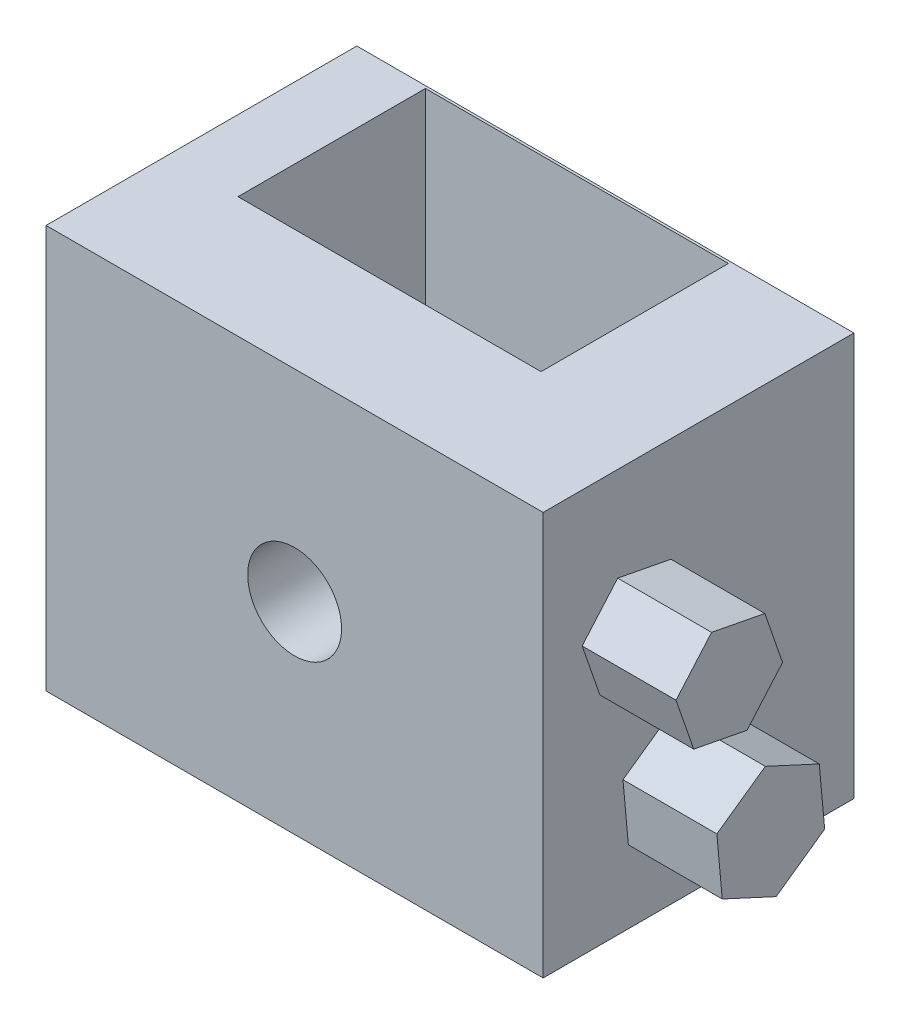
ISO-10303-21;
HEADER;
FILE_DESCRIPTION(('STEP AP214'),'2;1');
FILE_NAME('part.step','',(''),(''),'','','');
FILE_SCHEMA(('AUTOMOTIVE_DESIGN { 1 0 10303 214 1 1 1 1 }'));
ENDSEC;
DATA;
#1=APPLICATION_CONTEXT('core data for automotive mechanical design processes');
#2=APPLICATION_PROTOCOL_DEFINITION('international standard','automotive_design',2000,#1);
#3=PRODUCT_CONTEXT('',#1,'mechanical');
#4=PRODUCT('Part','Part','',(#3));
#5=PRODUCT_RELATED_PRODUCT_CATEGORY('part','',(#4));
#6=PRODUCT_DEFINITION_FORMATION('','',#4);
#7=PRODUCT_DEFINITION_CONTEXT('part definition',#1,'design');
#8=PRODUCT_DEFINITION('design','',#6,#7);
#9=PRODUCT_DEFINITION_SHAPE('','',#8);
#10=(LENGTH_UNIT() NAMED_UNIT(*) SI_UNIT(.MILLI.,.METRE.));
#11=(NAMED_UNIT(*) PLANE_ANGLE_UNIT() SI_UNIT($,.RADIAN.));
#12=(NAMED_UNIT(*) SI_UNIT($,.STERADIAN.) SOLID_ANGLE_UNIT());
#13=UNCERTAINTY_MEASURE_WITH_UNIT(LENGTH_MEASURE(1.E-05),#10,'distance_accuracy_value','');
#14=(GEOMETRIC_REPRESENTATION_CONTEXT(3) GLOBAL_UNCERTAINTY_ASSIGNED_CONTEXT((#13)) GLOBAL_UNIT_ASSIGNED_CONTEXT((#10,
#11,#12)) REPRESENTATION_CONTEXT('',''));
#15=CARTESIAN_POINT('',(0.,0.,0.));
#16=DIRECTION('',(0.,0.,1.));
#17=DIRECTION('',(1.,0.,0.));
#18=AXIS2_PLACEMENT_3D('',#15,#16,#17);
#19=CARTESIAN_POINT('',(67.2388486511686,-54.5381772392812,84.074));
#20=DIRECTION('',(-1.,0.,0.));
#21=DIRECTION('',(0.,0.,1.));
#22=AXIS2_PLACEMENT_3D('',#19,#20,#21);
#23=PLANE('',#22);
#24=DIRECTION('',(0.,-0.189703007503239,-0.981841519260734));
#25=VECTOR('',#24,1.);
#26=CARTESIAN_POINT('',(67.2388486511686,4.10971295609679,68.7348583094618));
#27=LINE('',#26,#25);
#28=CARTESIAN_POINT('',(67.2388486511686,4.10971295609679,68.7348583094618));
#29=VERTEX_POINT('',#28);
#30=CARTESIAN_POINT('',(67.2388486511686,1.32581893463048,54.3263216633009));
#31=VERTEX_POINT('',#30);
#32=EDGE_CURVE('E208',#29,#31,#27,.T.);
#33=ORIENTED_EDGE('',*,*,#32,.F.);
#34=DIRECTION('',(0.,-0.945151201921723,-0.326633135958252));
#35=VECTOR('',#34,1.);
#36=CARTESIAN_POINT('',(67.2388486511686,17.9798187337643,73.5282036885088));
#37=LINE('',#36,#35);
#38=CARTESIAN_POINT('',(67.2388486511686,17.9798187337643,73.5282036885088));
#39=VERTEX_POINT('',#38);
#40=EDGE_CURVE('E224',#39,#29,#37,.T.);
#41=ORIENTED_EDGE('',*,*,#40,.F.);
#42=DIRECTION('',(0.,-0.755448194418485,0.655208383302482));
#43=VECTOR('',#42,1.);
#44=CARTESIAN_POINT('',(67.2388486511686,29.0660304899655,63.9130124213949));
#45=LINE('',#44,#43);
#46=CARTESIAN_POINT('',(67.2388486511686,29.0660304899655,63.9130124213949));
#47=VERTEX_POINT('',#46);
#48=EDGE_CURVE('E251',#47,#39,#45,.T.);
#49=ORIENTED_EDGE('',*,*,#48,.F.);
#50=DIRECTION('',(0.,0.189703007503239,0.981841519260734));
#51=VECTOR('',#50,1.);
#52=CARTESIAN_POINT('',(67.2388486511686,26.2821364684992,49.504475775234));
#53=LINE('',#52,#51);
#54=CARTESIAN_POINT('',(67.2388486511686,26.2821364684992,49.504475775234));
#55=VERTEX_POINT('',#54);
#56=EDGE_CURVE('E247',#55,#47,#53,.T.);
#57=ORIENTED_EDGE('',*,*,#56,.F.);
#58=DIRECTION('',(0.,0.945151201921723,0.326633135958252));
#59=VECTOR('',#58,1.);
#60=CARTESIAN_POINT('',(67.2388486511686,12.4120306908317,44.711130396187));
#61=LINE('',#60,#59);
#62=CARTESIAN_POINT('',(67.2388486511686,12.4120306908317,44.711130396187));
#63=VERTEX_POINT('',#62);
#64=EDGE_CURVE('E243',#63,#55,#61,.T.);
#65=ORIENTED_EDGE('',*,*,#64,.F.);
#66=DIRECTION('',(0.,0.755448194418485,-0.655208383302482));
#67=VECTOR('',#66,1.);
#68=CARTESIAN_POINT('',(67.2388486511686,1.32581893463048,54.3263216633009));
#69=LINE('',#68,#67);
#70=EDGE_CURVE('E213',#31,#63,#69,.T.);
#71=ORIENTED_EDGE('',*,*,#70,.F.);
#72=EDGE_LOOP('',(#33,#41,#49,#57,#65,#71));
#73=FACE_BOUND('',#72,.T.);
#74=DIRECTION('',(0.,1.,0.));
#75=VECTOR('',#74,1.);
#76=CARTESIAN_POINT('',(67.2388486511686,-54.5381772392812,0.));
#77=LINE('',#76,#75);
#78=CARTESIAN_POINT('',(67.2388486511686,-54.5381772392812,0.));
#79=VERTEX_POINT('',#78);
#80=CARTESIAN_POINT('',(67.2388486511686,54.5381772392812,0.));
#81=VERTEX_POINT('',#80);
#82=EDGE_CURVE('E346',#79,#81,#77,.T.);
#83=ORIENTED_EDGE('',*,*,#82,.T.);
#84=DIRECTION('',(0.,0.,-1.));
#85=VECTOR('',#84,1.);
#86=CARTESIAN_POINT('',(67.2388486511686,54.5381772392812,84.074));
#87=LINE('',#86,#85);
#88=CARTESIAN_POINT('',(67.2388486511686,54.5381772392812,84.074));
#89=VERTEX_POINT('',#88);
#90=EDGE_CURVE('E11',#89,#81,#87,.T.);
#91=ORIENTED_EDGE('',*,*,#90,.F.);
#92=DIRECTION('',(0.,1.,0.));
#93=VECTOR('',#92,1.);
#94=CARTESIAN_POINT('',(67.2388486511686,-54.5381772392812,84.074));
#95=LINE('',#94,#93);
#96=CARTESIAN_POINT('',(67.2388486511686,-54.5381772392812,84.074));
#97=VERTEX_POINT('',#96);
#98=EDGE_CURVE('E331',#97,#89,#95,.T.);
#99=ORIENTED_EDGE('',*,*,#98,.F.);
#100=DIRECTION('',(0.,0.,-1.));
#101=VECTOR('',#100,1.);
#102=CARTESIAN_POINT('',(67.2388486511686,-54.5381772392812,84.074));
#103=LINE('',#102,#101);
#104=EDGE_CURVE('E345',#97,#79,#103,.T.);
#105=ORIENTED_EDGE('',*,*,#104,.T.);
#106=EDGE_LOOP('',(#83,#91,#99,#105));
#107=FACE_BOUND('',#106,.T.);
#108=DIRECTION('',(0.,0.576786803851008,-0.816894719595701));
#109=VECTOR('',#108,1.);
#110=CARTESIAN_POINT('',(67.2388486511686,-41.5941660783579,46.4384819136081));
#111=LINE('',#110,#109);
#112=CARTESIAN_POINT('',(67.2388486511686,-41.5941660783579,46.4384819136081));
#113=VERTEX_POINT('',#112);
#114=CARTESIAN_POINT('',(67.2388486511686,-32.3295847905922,33.3171908530105));
#115=VERTEX_POINT('',#114);
#116=EDGE_CURVE('E206',#113,#115,#111,.T.);
#117=ORIENTED_EDGE('',*,*,#116,.F.);
#118=DIRECTION('',(0.,-0.419058177461739,-0.907959384500455));
#119=VECTOR('',#118,1.);
#120=CARTESIAN_POINT('',(67.2388486511686,-34.8630853333135,61.022490194538));
#121=LINE('',#120,#119);
#122=CARTESIAN_POINT('',(67.2388486511686,-34.8630853333135,61.022490194538));
#123=VERTEX_POINT('',#122);
#124=EDGE_CURVE('E203',#123,#113,#121,.T.);
#125=ORIENTED_EDGE('',*,*,#124,.F.);
#126=DIRECTION('',(0.,-0.995844981312747,-0.0910646649047542));
#127=VECTOR('',#126,1.);
#128=CARTESIAN_POINT('',(67.2388486511686,-18.8674233005034,62.4852074148702));
#129=LINE('',#128,#127);
#130=CARTESIAN_POINT('',(67.2388486511686,-18.8674233005034,62.4852074148702));
#131=VERTEX_POINT('',#130);
#132=EDGE_CURVE('E420',#131,#123,#129,.T.);
#133=ORIENTED_EDGE('',*,*,#132,.F.);
#134=DIRECTION('',(0.,-0.576786803851007,0.816894719595701));
#135=VECTOR('',#134,1.);
#136=CARTESIAN_POINT('',(67.2388486511686,-9.6028420127377,49.3639163542725));
#137=LINE('',#136,#135);
#138=CARTESIAN_POINT('',(67.2388486511686,-9.6028420127377,49.3639163542725));
#139=VERTEX_POINT('',#138);
#140=EDGE_CURVE('E442',#139,#131,#137,.T.);
#141=ORIENTED_EDGE('',*,*,#140,.F.);
#142=DIRECTION('',(0.,0.419058177461739,0.907959384500455));
#143=VECTOR('',#142,1.);
#144=CARTESIAN_POINT('',(67.2388486511686,-16.3339227577821,34.7799080733426));
#145=LINE('',#144,#143);
#146=CARTESIAN_POINT('',(67.2388486511686,-16.3339227577821,34.7799080733426));
#147=VERTEX_POINT('',#146);
#148=EDGE_CURVE('E67',#147,#139,#145,.T.);
#149=ORIENTED_EDGE('',*,*,#148,.F.);
#150=DIRECTION('',(0.,0.995844981312747,0.0910646649047533));
#151=VECTOR('',#150,1.);
#152=CARTESIAN_POINT('',(67.2388486511686,-32.3295847905922,33.3171908530105));
#153=LINE('',#152,#151);
#154=EDGE_CURVE('E62',#115,#147,#153,.T.);
#155=ORIENTED_EDGE('',*,*,#154,.F.);
#156=EDGE_LOOP('',(#117,#125,#133,#141,#149,#155));
#157=FACE_BOUND('',#156,.T.);
#158=ADVANCED_FACE('F45',(#73,#107,#157),#23,.F.);
#159=CARTESIAN_POINT('',(0.,0.,-42.926));
#160=DIRECTION('',(0.,0.,1.));
#161=DIRECTION('',(1.,0.,0.));
#162=AXIS2_PLACEMENT_3D('',#159,#160,#161);
#163=CYLINDRICAL_SURFACE('',#162,12.7);
#164=CARTESIAN_POINT('',(0.,0.,0.66811293930074));
#165=DIRECTION('',(0.,0.,-1.));
#166=DIRECTION('',(-1.,0.,0.));
#167=AXIS2_PLACEMENT_3D('',#164,#165,#166);
#168=CIRCLE('',#167,12.7);
#169=CARTESIAN_POINT('',(-12.7,0.,0.66811293930074));
#170=VERTEX_POINT('',#169);
#171=EDGE_CURVE('E48',#170,#170,#168,.F.);
#172=ORIENTED_EDGE('',*,*,#171,.T.);
#173=EDGE_LOOP('',(#172));
#174=FACE_BOUND('',#173,.T.);
#175=CARTESIAN_POINT('',(0.,0.,0.));
#176=DIRECTION('',(0.,0.,-1.));
#177=DIRECTION('',(-1.,0.,0.));
#178=AXIS2_PLACEMENT_3D('',#175,#176,#177);
#179=CIRCLE('',#178,12.7);
#180=CARTESIAN_POINT('',(-12.7,0.,0.));
#181=VERTEX_POINT('',#180);
#182=EDGE_CURVE('E330',#181,#181,#179,.T.);
#183=ORIENTED_EDGE('',*,*,#182,.T.);
#184=EDGE_LOOP('',(#183));
#185=FACE_BOUND('',#184,.T.);
#186=ADVANCED_FACE('F378',(#174,#185),#163,.F.);
#187=CARTESIAN_POINT('',(-67.2388486511686,54.5381772392812,84.074));
#188=DIRECTION('',(0.,-1.,0.));
#189=DIRECTION('',(0.,0.,-1.));
#190=AXIS2_PLACEMENT_3D('',#187,#188,#189);
#191=PLANE('',#190);
#192=DIRECTION('',(1.,0.,0.));
#193=VECTOR('',#192,1.);
#194=CARTESIAN_POINT('',(-48.0130117946654,54.5381772392812,51.375241628256));
#195=LINE('',#194,#193);
#196=CARTESIAN_POINT('',(-48.0130117946654,54.5381772392812,51.375241628256));
#197=VERTEX_POINT('',#196);
#198=CARTESIAN_POINT('',(33.9651165601541,54.5381772392812,51.375241628256));
#199=VERTEX_POINT('',#198);
#200=EDGE_CURVE('E302',#197,#199,#195,.T.);
#201=ORIENTED_EDGE('',*,*,#200,.F.);
#202=DIRECTION('',(0.,0.,1.));
#203=VECTOR('',#202,1.);
#204=CARTESIAN_POINT('',(-48.0130117946654,54.5381772392812,0.668112939300743));
#205=LINE('',#204,#203);
#206=CARTESIAN_POINT('',(-48.0130117946654,54.5381772392812,0.668112939300743));
#207=VERTEX_POINT('',#206);
#208=EDGE_CURVE('E281',#207,#197,#205,.T.);
#209=ORIENTED_EDGE('',*,*,#208,.F.);
#210=DIRECTION('',(-1.,0.,0.));
#211=VECTOR('',#210,1.);
#212=CARTESIAN_POINT('',(-48.0130117946654,54.5381772392812,0.668112939300743));
#213=LINE('',#212,#211);
#214=CARTESIAN_POINT('',(33.9651165601541,54.5381772392812,0.668112939300743));
#215=VERTEX_POINT('',#214);
#216=EDGE_CURVE('E287',#215,#207,#213,.T.);
#217=ORIENTED_EDGE('',*,*,#216,.F.);
#218=DIRECTION('',(0.,0.,-1.));
#219=VECTOR('',#218,1.);
#220=CARTESIAN_POINT('',(33.9651165601541,54.5381772392812,0.668112939300743));
#221=LINE('',#220,#219);
#222=EDGE_CURVE('E306',#199,#215,#221,.T.);
#223=ORIENTED_EDGE('',*,*,#222,.F.);
#224=EDGE_LOOP('',(#201,#209,#217,#223));
#225=FACE_BOUND('',#224,.T.);
#226=DIRECTION('',(-1.,0.,0.));
#227=VECTOR('',#226,1.);
#228=CARTESIAN_POINT('',(-67.2388486511686,54.5381772392812,0.));
#229=LINE('',#228,#227);
#230=CARTESIAN_POINT('',(-67.2388486511686,54.5381772392812,0.));
#231=VERTEX_POINT('',#230);
#232=EDGE_CURVE('E350',#81,#231,#229,.T.);
#233=ORIENTED_EDGE('',*,*,#232,.T.);
#234=DIRECTION('',(0.,0.,-1.));
#235=VECTOR('',#234,1.);
#236=CARTESIAN_POINT('',(-67.2388486511686,54.5381772392812,84.074));
#237=LINE('',#236,#235);
#238=CARTESIAN_POINT('',(-67.2388486511686,54.5381772392812,84.074));
#239=VERTEX_POINT('',#238);
#240=EDGE_CURVE('E54',#239,#231,#237,.T.);
#241=ORIENTED_EDGE('',*,*,#240,.F.);
#242=DIRECTION('',(-1.,0.,0.));
#243=VECTOR('',#242,1.);
#244=CARTESIAN_POINT('',(-67.2388486511686,54.5381772392812,84.074));
#245=LINE('',#244,#243);
#246=EDGE_CURVE('E335',#89,#239,#245,.T.);
#247=ORIENTED_EDGE('',*,*,#246,.F.);
#248=ORIENTED_EDGE('',*,*,#90,.T.);
#249=EDGE_LOOP('',(#233,#241,#247,#248));
#250=FACE_BOUND('',#249,.T.);
#251=ADVANCED_FACE('F405',(#225,#250),#191,.F.);
#252=CARTESIAN_POINT('',(-67.2388486511686,-54.5381772392812,84.074));
#253=DIRECTION('',(1.,0.,0.));
#254=DIRECTION('',(0.,0.,-1.));
#255=AXIS2_PLACEMENT_3D('',#252,#253,#254);
#256=PLANE('',#255);
#257=DIRECTION('',(0.,-1.,0.));
#258=VECTOR('',#257,1.);
#259=CARTESIAN_POINT('',(-67.2388486511686,-54.5381772392812,0.));
#260=LINE('',#259,#258);
#261=CARTESIAN_POINT('',(-67.2388486511686,-54.5381772392812,0.));
#262=VERTEX_POINT('',#261);
#263=EDGE_CURVE('E353',#231,#262,#260,.T.);
#264=ORIENTED_EDGE('',*,*,#263,.T.);
#265=DIRECTION('',(0.,0.,-1.));
#266=VECTOR('',#265,1.);
#267=CARTESIAN_POINT('',(-67.2388486511686,-54.5381772392812,84.074));
#268=LINE('',#267,#266);
#269=CARTESIAN_POINT('',(-67.2388486511686,-54.5381772392812,84.074));
#270=VERTEX_POINT('',#269);
#271=EDGE_CURVE('E361',#270,#262,#268,.T.);
#272=ORIENTED_EDGE('',*,*,#271,.F.);
#273=DIRECTION('',(0.,-1.,0.));
#274=VECTOR('',#273,1.);
#275=CARTESIAN_POINT('',(-67.2388486511686,-54.5381772392812,84.074));
#276=LINE('',#275,#274);
#277=EDGE_CURVE('E339',#239,#270,#276,.T.);
#278=ORIENTED_EDGE('',*,*,#277,.F.);
#279=ORIENTED_EDGE('',*,*,#240,.T.);
#280=EDGE_LOOP('',(#264,#272,#278,#279));
#281=FACE_BOUND('',#280,.T.);
#282=ADVANCED_FACE('F524',(#281),#256,.F.);
#283=CARTESIAN_POINT('',(-67.2388486511686,-54.5381772392812,84.074));
#284=DIRECTION('',(0.,1.,0.));
#285=DIRECTION('',(0.,0.,1.));
#286=AXIS2_PLACEMENT_3D('',#283,#284,#285);
#287=PLANE('',#286);
#288=DIRECTION('',(1.,0.,0.));
#289=VECTOR('',#288,1.);
#290=CARTESIAN_POINT('',(-67.2388486511686,-54.5381772392812,0.));
#291=LINE('',#290,#289);
#292=EDGE_CURVE('E336',#262,#79,#291,.T.);
#293=ORIENTED_EDGE('',*,*,#292,.T.);
#294=ORIENTED_EDGE('',*,*,#104,.F.);
#295=DIRECTION('',(1.,0.,0.));
#296=VECTOR('',#295,1.);
#297=CARTESIAN_POINT('',(-67.2388486511686,-54.5381772392812,84.074));
#298=LINE('',#297,#296);
#299=EDGE_CURVE('E342',#270,#97,#298,.T.);
#300=ORIENTED_EDGE('',*,*,#299,.F.);
#301=ORIENTED_EDGE('',*,*,#271,.T.);
#302=EDGE_LOOP('',(#293,#294,#300,#301));
#303=FACE_BOUND('',#302,.T.);
#304=ADVANCED_FACE('F534',(#303),#287,.F.);
#305=CARTESIAN_POINT('',(0.,0.,84.074));
#306=DIRECTION('',(0.,0.,-1.));
#307=DIRECTION('',(-1.,0.,0.));
#308=AXIS2_PLACEMENT_3D('',#305,#306,#307);
#309=PLANE('',#308);
#310=CARTESIAN_POINT('',(0.,0.,84.074));
#311=DIRECTION('',(0.,0.,1.));
#312=DIRECTION('',(1.,0.,0.));
#313=AXIS2_PLACEMENT_3D('',#310,#311,#312);
#314=CIRCLE('',#313,12.7);
#315=CARTESIAN_POINT('',(12.7,0.,84.074));
#316=VERTEX_POINT('',#315);
#317=EDGE_CURVE('E326',#316,#316,#314,.T.);
#318=ORIENTED_EDGE('',*,*,#317,.F.);
#319=EDGE_LOOP('',(#318));
#320=FACE_BOUND('',#319,.T.);
#321=ORIENTED_EDGE('',*,*,#98,.T.);
#322=ORIENTED_EDGE('',*,*,#246,.T.);
#323=ORIENTED_EDGE('',*,*,#277,.T.);
#324=ORIENTED_EDGE('',*,*,#299,.T.);
#325=EDGE_LOOP('',(#321,#322,#323,#324));
#326=FACE_BOUND('',#325,.T.);
#327=ADVANCED_FACE('F538',(#320,#326),#309,.F.);
#328=CARTESIAN_POINT('',(0.,0.,0.));
#329=DIRECTION('',(0.,0.,-1.));
#330=DIRECTION('',(-1.,0.,0.));
#331=AXIS2_PLACEMENT_3D('',#328,#329,#330);
#332=PLANE('',#331);
#333=ORIENTED_EDGE('',*,*,#182,.F.);
#334=EDGE_LOOP('',(#333));
#335=FACE_BOUND('',#334,.T.);
#336=ORIENTED_EDGE('',*,*,#82,.F.);
#337=ORIENTED_EDGE('',*,*,#292,.F.);
#338=ORIENTED_EDGE('',*,*,#263,.F.);
#339=ORIENTED_EDGE('',*,*,#232,.F.);
#340=EDGE_LOOP('',(#336,#337,#338,#339));
#341=FACE_BOUND('',#340,.T.);
#342=ADVANCED_FACE('F394',(#335,#341),#332,.T.);
#343=CARTESIAN_POINT('',(0.,0.,51.375241628256));
#344=DIRECTION('',(0.,0.,1.));
#345=DIRECTION('',(1.,0.,0.));
#346=AXIS2_PLACEMENT_3D('',#343,#344,#345);
#347=CIRCLE('',#346,12.7);
#348=CARTESIAN_POINT('',(12.7,0.,51.375241628256));
#349=VERTEX_POINT('',#348);
#350=EDGE_CURVE('E316',#349,#349,#347,.F.);
#351=ORIENTED_EDGE('',*,*,#350,.T.);
#352=EDGE_LOOP('',(#351));
#353=FACE_BOUND('',#352,.T.);
#354=ORIENTED_EDGE('',*,*,#317,.T.);
#355=EDGE_LOOP('',(#354));
#356=FACE_BOUND('',#355,.T.);
#357=ADVANCED_FACE('F384',(#353,#356),#163,.F.);
#358=CARTESIAN_POINT('',(-48.0130117946654,-49.6018227607188,0.668112939300743));
#359=DIRECTION('',(0.,0.,-1.));
#360=DIRECTION('',(-1.,0.,0.));
#361=AXIS2_PLACEMENT_3D('',#358,#359,#360);
#362=PLANE('',#361);
#363=ORIENTED_EDGE('',*,*,#216,.T.);
#364=DIRECTION('',(0.,1.,0.));
#365=VECTOR('',#364,1.);
#366=CARTESIAN_POINT('',(-48.0130117946654,-49.6018227607188,0.668112939300743));
#367=LINE('',#366,#365);
#368=CARTESIAN_POINT('',(-48.0130117946654,-49.6018227607188,0.668112939300743));
#369=VERTEX_POINT('',#368);
#370=EDGE_CURVE('E313',#369,#207,#367,.T.);
#371=ORIENTED_EDGE('',*,*,#370,.F.);
#372=DIRECTION('',(-1.,0.,0.));
#373=VECTOR('',#372,1.);
#374=CARTESIAN_POINT('',(-48.0130117946654,-49.6018227607188,0.668112939300743));
#375=LINE('',#374,#373);
#376=CARTESIAN_POINT('',(33.9651165601541,-49.6018227607188,0.668112939300743));
#377=VERTEX_POINT('',#376);
#378=EDGE_CURVE('E295',#377,#369,#375,.T.);
#379=ORIENTED_EDGE('',*,*,#378,.F.);
#380=DIRECTION('',(0.,1.,0.));
#381=VECTOR('',#380,1.);
#382=CARTESIAN_POINT('',(33.9651165601541,-49.6018227607188,0.668112939300743));
#383=LINE('',#382,#381);
#384=EDGE_CURVE('E317',#377,#215,#383,.T.);
#385=ORIENTED_EDGE('',*,*,#384,.T.);
#386=EDGE_LOOP('',(#363,#371,#379,#385));
#387=FACE_BOUND('',#386,.T.);
#388=ORIENTED_EDGE('',*,*,#171,.F.);
#389=EDGE_LOOP('',(#388));
#390=FACE_BOUND('',#389,.T.);
#391=ADVANCED_FACE('F381',(#387,#390),#362,.F.);
#392=CARTESIAN_POINT('',(-48.0130117946654,-49.6018227607188,51.375241628256));
#393=DIRECTION('',(0.,0.,1.));
#394=DIRECTION('',(1.,0.,0.));
#395=AXIS2_PLACEMENT_3D('',#392,#393,#394);
#396=PLANE('',#395);
#397=ORIENTED_EDGE('',*,*,#200,.T.);
#398=DIRECTION('',(0.,1.,0.));
#399=VECTOR('',#398,1.);
#400=CARTESIAN_POINT('',(33.9651165601541,-49.6018227607188,51.375241628256));
#401=LINE('',#400,#399);
#402=CARTESIAN_POINT('',(33.9651165601541,-49.6018227607188,51.375241628256));
#403=VERTEX_POINT('',#402);
#404=EDGE_CURVE('E320',#403,#199,#401,.T.);
#405=ORIENTED_EDGE('',*,*,#404,.F.);
#406=DIRECTION('',(1.,0.,0.));
#407=VECTOR('',#406,1.);
#408=CARTESIAN_POINT('',(-48.0130117946654,-49.6018227607188,51.375241628256));
#409=LINE('',#408,#407);
#410=CARTESIAN_POINT('',(-48.0130117946654,-49.6018227607188,51.375241628256));
#411=VERTEX_POINT('',#410);
#412=EDGE_CURVE('E286',#411,#403,#409,.T.);
#413=ORIENTED_EDGE('',*,*,#412,.F.);
#414=DIRECTION('',(0.,1.,0.));
#415=VECTOR('',#414,1.);
#416=CARTESIAN_POINT('',(-48.0130117946654,-49.6018227607188,51.375241628256));
#417=LINE('',#416,#415);
#418=EDGE_CURVE('E299',#411,#197,#417,.T.);
#419=ORIENTED_EDGE('',*,*,#418,.T.);
#420=EDGE_LOOP('',(#397,#405,#413,#419));
#421=FACE_BOUND('',#420,.T.);
#422=ORIENTED_EDGE('',*,*,#350,.F.);
#423=EDGE_LOOP('',(#422));
#424=FACE_BOUND('',#423,.T.);
#425=ADVANCED_FACE('F383',(#421,#424),#396,.F.);
#426=CARTESIAN_POINT('',(-48.0130117946654,-49.6018227607188,0.668112939300743));
#427=DIRECTION('',(-1.,0.,0.));
#428=DIRECTION('',(0.,0.,1.));
#429=AXIS2_PLACEMENT_3D('',#426,#427,#428);
#430=PLANE('',#429);
#431=ORIENTED_EDGE('',*,*,#208,.T.);
#432=ORIENTED_EDGE('',*,*,#418,.F.);
#433=DIRECTION('',(0.,0.,1.));
#434=VECTOR('',#433,1.);
#435=CARTESIAN_POINT('',(-48.0130117946654,-49.6018227607188,0.668112939300743));
#436=LINE('',#435,#434);
#437=EDGE_CURVE('E282',#369,#411,#436,.T.);
#438=ORIENTED_EDGE('',*,*,#437,.F.);
#439=ORIENTED_EDGE('',*,*,#370,.T.);
#440=EDGE_LOOP('',(#431,#432,#438,#439));
#441=FACE_BOUND('',#440,.T.);
#442=ADVANCED_FACE('F391',(#441),#430,.F.);
#443=CARTESIAN_POINT('',(33.9651165601541,-49.6018227607188,0.668112939300743));
#444=DIRECTION('',(1.,0.,0.));
#445=DIRECTION('',(0.,0.,-1.));
#446=AXIS2_PLACEMENT_3D('',#443,#444,#445);
#447=PLANE('',#446);
#448=ORIENTED_EDGE('',*,*,#222,.T.);
#449=ORIENTED_EDGE('',*,*,#384,.F.);
#450=DIRECTION('',(0.,0.,-1.));
#451=VECTOR('',#450,1.);
#452=CARTESIAN_POINT('',(33.9651165601541,-49.6018227607188,0.668112939300743));
#453=LINE('',#452,#451);
#454=EDGE_CURVE('E291',#403,#377,#453,.T.);
#455=ORIENTED_EDGE('',*,*,#454,.F.);
#456=ORIENTED_EDGE('',*,*,#404,.T.);
#457=EDGE_LOOP('',(#448,#449,#455,#456));
#458=FACE_BOUND('',#457,.T.);
#459=ADVANCED_FACE('F505',(#458),#447,.F.);
#460=CARTESIAN_POINT('',(0.,-49.6018227607188,0.));
#461=DIRECTION('',(0.,1.,0.));
#462=DIRECTION('',(0.,0.,1.));
#463=AXIS2_PLACEMENT_3D('',#460,#461,#462);
#464=PLANE('',#463);
#465=ORIENTED_EDGE('',*,*,#437,.T.);
#466=ORIENTED_EDGE('',*,*,#412,.T.);
#467=ORIENTED_EDGE('',*,*,#454,.T.);
#468=ORIENTED_EDGE('',*,*,#378,.T.);
#469=EDGE_LOOP('',(#465,#466,#467,#468));
#470=FACE_BOUND('',#469,.T.);
#471=ADVANCED_FACE('F502',(#470),#464,.T.);
#472=CARTESIAN_POINT('',(92.6388486511686,4.10971295609679,68.7348583094618));
#473=DIRECTION('',(0.,0.981841519260734,-0.189703007503239));
#474=DIRECTION('',(0.,0.189703007503239,0.981841519260734));
#475=AXIS2_PLACEMENT_3D('',#472,#473,#474);
#476=PLANE('',#475);
#477=ORIENTED_EDGE('',*,*,#32,.T.);
#478=DIRECTION('',(-1.,0.,0.));
#479=VECTOR('',#478,1.);
#480=CARTESIAN_POINT('',(92.6388486511686,1.32581893463048,54.3263216633009));
#481=LINE('',#480,#479);
#482=CARTESIAN_POINT('',(92.6388486511686,1.32581893463048,54.3263216633009));
#483=VERTEX_POINT('',#482);
#484=EDGE_CURVE('E277',#483,#31,#481,.T.);
#485=ORIENTED_EDGE('',*,*,#484,.F.);
#486=DIRECTION('',(0.,-0.189703007503239,-0.981841519260734));
#487=VECTOR('',#486,1.);
#488=CARTESIAN_POINT('',(92.6388486511686,4.10971295609679,68.7348583094618));
#489=LINE('',#488,#487);
#490=CARTESIAN_POINT('',(92.6388486511686,4.10971295609679,68.7348583094618));
#491=VERTEX_POINT('',#490);
#492=EDGE_CURVE('E219',#491,#483,#489,.T.);
#493=ORIENTED_EDGE('',*,*,#492,.F.);
#494=DIRECTION('',(-1.,0.,0.));
#495=VECTOR('',#494,1.);
#496=CARTESIAN_POINT('',(92.6388486511686,4.10971295609679,68.7348583094618));
#497=LINE('',#496,#495);
#498=EDGE_CURVE('E238',#491,#29,#497,.T.);
#499=ORIENTED_EDGE('',*,*,#498,.T.);
#500=EDGE_LOOP('',(#477,#485,#493,#499));
#501=FACE_BOUND('',#500,.T.);
#502=ADVANCED_FACE('F499',(#501),#476,.F.);
#503=CARTESIAN_POINT('',(92.6388486511686,1.32581893463048,54.3263216633009));
#504=DIRECTION('',(0.,0.655208383302482,0.755448194418485));
#505=DIRECTION('',(0.,-0.755448194418485,0.655208383302482));
#506=AXIS2_PLACEMENT_3D('',#503,#504,#505);
#507=PLANE('',#506);
#508=ORIENTED_EDGE('',*,*,#70,.T.);
#509=DIRECTION('',(-1.,0.,0.));
#510=VECTOR('',#509,1.);
#511=CARTESIAN_POINT('',(92.6388486511686,12.4120306908317,44.711130396187));
#512=LINE('',#511,#510);
#513=CARTESIAN_POINT('',(92.6388486511686,12.4120306908317,44.711130396187));
#514=VERTEX_POINT('',#513);
#515=EDGE_CURVE('E273',#514,#63,#512,.T.);
#516=ORIENTED_EDGE('',*,*,#515,.F.);
#517=DIRECTION('',(0.,0.755448194418485,-0.655208383302482));
#518=VECTOR('',#517,1.);
#519=CARTESIAN_POINT('',(92.6388486511686,1.32581893463048,54.3263216633009));
#520=LINE('',#519,#518);
#521=EDGE_CURVE('E223',#483,#514,#520,.T.);
#522=ORIENTED_EDGE('',*,*,#521,.F.);
#523=ORIENTED_EDGE('',*,*,#484,.T.);
#524=EDGE_LOOP('',(#508,#516,#522,#523));
#525=FACE_BOUND('',#524,.T.);
#526=ADVANCED_FACE('F495',(#525),#507,.F.);
#527=CARTESIAN_POINT('',(92.6388486511686,12.4120306908317,44.711130396187));
#528=DIRECTION('',(0.,-0.326633135958252,0.945151201921723));
#529=DIRECTION('',(0.,-0.945151201921723,-0.326633135958252));
#530=AXIS2_PLACEMENT_3D('',#527,#528,#529);
#531=PLANE('',#530);
#532=ORIENTED_EDGE('',*,*,#64,.T.);
#533=DIRECTION('',(-1.,0.,0.));
#534=VECTOR('',#533,1.);
#535=CARTESIAN_POINT('',(92.6388486511686,26.2821364684992,49.504475775234));
#536=LINE('',#535,#534);
#537=CARTESIAN_POINT('',(92.6388486511686,26.2821364684992,49.504475775234));
#538=VERTEX_POINT('',#537);
#539=EDGE_CURVE('E269',#538,#55,#536,.T.);
#540=ORIENTED_EDGE('',*,*,#539,.F.);
#541=DIRECTION('',(0.,0.945151201921723,0.326633135958252));
#542=VECTOR('',#541,1.);
#543=CARTESIAN_POINT('',(92.6388486511686,12.4120306908317,44.711130396187));
#544=LINE('',#543,#542);
#545=EDGE_CURVE('E227',#514,#538,#544,.T.);
#546=ORIENTED_EDGE('',*,*,#545,.F.);
#547=ORIENTED_EDGE('',*,*,#515,.T.);
#548=EDGE_LOOP('',(#532,#540,#546,#547));
#549=FACE_BOUND('',#548,.T.);
#550=ADVANCED_FACE('F491',(#549),#531,.F.);
#551=CARTESIAN_POINT('',(92.6388486511686,26.2821364684992,49.504475775234));
#552=DIRECTION('',(0.,-0.981841519260734,0.189703007503239));
#553=DIRECTION('',(0.,-0.189703007503239,-0.981841519260734));
#554=AXIS2_PLACEMENT_3D('',#551,#552,#553);
#555=PLANE('',#554);
#556=ORIENTED_EDGE('',*,*,#56,.T.);
#557=DIRECTION('',(-1.,0.,0.));
#558=VECTOR('',#557,1.);
#559=CARTESIAN_POINT('',(92.6388486511686,29.0660304899655,63.9130124213949));
#560=LINE('',#559,#558);
#561=CARTESIAN_POINT('',(92.6388486511686,29.0660304899655,63.9130124213949));
#562=VERTEX_POINT('',#561);
#563=EDGE_CURVE('E265',#562,#47,#560,.T.);
#564=ORIENTED_EDGE('',*,*,#563,.F.);
#565=DIRECTION('',(0.,0.189703007503239,0.981841519260734));
#566=VECTOR('',#565,1.);
#567=CARTESIAN_POINT('',(92.6388486511686,26.2821364684992,49.504475775234));
#568=LINE('',#567,#566);
#569=EDGE_CURVE('E230',#538,#562,#568,.T.);
#570=ORIENTED_EDGE('',*,*,#569,.F.);
#571=ORIENTED_EDGE('',*,*,#539,.T.);
#572=EDGE_LOOP('',(#556,#564,#570,#571));
#573=FACE_BOUND('',#572,.T.);
#574=ADVANCED_FACE('F487',(#573),#555,.F.);
#575=CARTESIAN_POINT('',(92.6388486511686,29.0660304899655,63.9130124213949));
#576=DIRECTION('',(0.,-0.655208383302482,-0.755448194418485));
#577=DIRECTION('',(0.,0.755448194418485,-0.655208383302482));
#578=AXIS2_PLACEMENT_3D('',#575,#576,#577);
#579=PLANE('',#578);
#580=ORIENTED_EDGE('',*,*,#48,.T.);
#581=DIRECTION('',(-1.,0.,0.));
#582=VECTOR('',#581,1.);
#583=CARTESIAN_POINT('',(92.6388486511686,17.9798187337643,73.5282036885088));
#584=LINE('',#583,#582);
#585=CARTESIAN_POINT('',(92.6388486511686,17.9798187337643,73.5282036885088));
#586=VERTEX_POINT('',#585);
#587=EDGE_CURVE('E261',#586,#39,#584,.T.);
#588=ORIENTED_EDGE('',*,*,#587,.F.);
#589=DIRECTION('',(0.,-0.755448194418485,0.655208383302482));
#590=VECTOR('',#589,1.);
#591=CARTESIAN_POINT('',(92.6388486511686,29.0660304899655,63.9130124213949));
#592=LINE('',#591,#590);
#593=EDGE_CURVE('E233',#562,#586,#592,.T.);
#594=ORIENTED_EDGE('',*,*,#593,.F.);
#595=ORIENTED_EDGE('',*,*,#563,.T.);
#596=EDGE_LOOP('',(#580,#588,#594,#595));
#597=FACE_BOUND('',#596,.T.);
#598=ADVANCED_FACE('F483',(#597),#579,.F.);
#599=CARTESIAN_POINT('',(92.6388486511686,17.9798187337643,73.5282036885088));
#600=DIRECTION('',(0.,0.326633135958252,-0.945151201921723));
#601=DIRECTION('',(0.,0.945151201921723,0.326633135958252));
#602=AXIS2_PLACEMENT_3D('',#599,#600,#601);
#603=PLANE('',#602);
#604=ORIENTED_EDGE('',*,*,#40,.T.);
#605=ORIENTED_EDGE('',*,*,#498,.F.);
#606=DIRECTION('',(0.,-0.945151201921723,-0.326633135958252));
#607=VECTOR('',#606,1.);
#608=CARTESIAN_POINT('',(92.6388486511686,17.9798187337643,73.5282036885088));
#609=LINE('',#608,#607);
#610=EDGE_CURVE('E236',#586,#491,#609,.T.);
#611=ORIENTED_EDGE('',*,*,#610,.F.);
#612=ORIENTED_EDGE('',*,*,#587,.T.);
#613=EDGE_LOOP('',(#604,#605,#611,#612));
#614=FACE_BOUND('',#613,.T.);
#615=ADVANCED_FACE('F479',(#614),#603,.F.);
#616=CARTESIAN_POINT('',(92.6388486511686,0.,0.));
#617=DIRECTION('',(1.,0.,0.));
#618=DIRECTION('',(0.,0.,-1.));
#619=AXIS2_PLACEMENT_3D('',#616,#617,#618);
#620=PLANE('',#619);
#621=ORIENTED_EDGE('',*,*,#492,.T.);
#622=ORIENTED_EDGE('',*,*,#521,.T.);
#623=ORIENTED_EDGE('',*,*,#545,.T.);
#624=ORIENTED_EDGE('',*,*,#569,.T.);
#625=ORIENTED_EDGE('',*,*,#593,.T.);
#626=ORIENTED_EDGE('',*,*,#610,.T.);
#627=EDGE_LOOP('',(#621,#622,#623,#624,#625,#626));
#628=FACE_BOUND('',#627,.T.);
#629=ADVANCED_FACE('F477',(#628),#620,.T.);
#630=CARTESIAN_POINT('',(92.6388486511686,-41.5941660783579,46.4384819136081));
#631=DIRECTION('',(0.,0.816894719595701,0.576786803851008));
#632=DIRECTION('',(0.,-0.576786803851008,0.816894719595701));
#633=AXIS2_PLACEMENT_3D('',#630,#631,#632);
#634=PLANE('',#633);
#635=ORIENTED_EDGE('',*,*,#116,.T.);
#636=DIRECTION('',(-1.,0.,0.));
#637=VECTOR('',#636,1.);
#638=CARTESIAN_POINT('',(92.6388486511686,-32.3295847905922,33.3171908530105));
#639=LINE('',#638,#637);
#640=CARTESIAN_POINT('',(92.6388486511686,-32.3295847905922,33.3171908530105));
#641=VERTEX_POINT('',#640);
#642=EDGE_CURVE('E185',#641,#115,#639,.T.);
#643=ORIENTED_EDGE('',*,*,#642,.F.);
#644=DIRECTION('',(0.,0.576786803851008,-0.816894719595701));
#645=VECTOR('',#644,1.);
#646=CARTESIAN_POINT('',(92.6388486511686,-41.5941660783579,46.4384819136081));
#647=LINE('',#646,#645);
#648=CARTESIAN_POINT('',(92.6388486511686,-41.5941660783579,46.4384819136081));
#649=VERTEX_POINT('',#648);
#650=EDGE_CURVE('E193',#649,#641,#647,.T.);
#651=ORIENTED_EDGE('',*,*,#650,.F.);
#652=DIRECTION('',(-1.,0.,0.));
#653=VECTOR('',#652,1.);
#654=CARTESIAN_POINT('',(92.6388486511686,-41.5941660783579,46.4384819136081));
#655=LINE('',#654,#653);
#656=EDGE_CURVE('E416',#649,#113,#655,.T.);
#657=ORIENTED_EDGE('',*,*,#656,.T.);
#658=EDGE_LOOP('',(#635,#643,#651,#657));
#659=FACE_BOUND('',#658,.T.);
#660=ADVANCED_FACE('F205',(#659),#634,.F.);
#661=CARTESIAN_POINT('',(92.6388486511686,-32.3295847905922,33.3171908530105));
#662=DIRECTION('',(0.,-0.0910646649047533,0.995844981312747));
#663=DIRECTION('',(0.,-0.995844981312747,-0.0910646649047533));
#664=AXIS2_PLACEMENT_3D('',#661,#662,#663);
#665=PLANE('',#664);
#666=ORIENTED_EDGE('',*,*,#154,.T.);
#667=DIRECTION('',(-1.,0.,0.));
#668=VECTOR('',#667,1.);
#669=CARTESIAN_POINT('',(92.6388486511686,-16.3339227577821,34.7799080733426));
#670=LINE('',#669,#668);
#671=CARTESIAN_POINT('',(92.6388486511686,-16.3339227577821,34.7799080733426));
#672=VERTEX_POINT('',#671);
#673=EDGE_CURVE('E188',#672,#147,#670,.T.);
#674=ORIENTED_EDGE('',*,*,#673,.F.);
#675=DIRECTION('',(0.,0.995844981312747,0.0910646649047533));
#676=VECTOR('',#675,1.);
#677=CARTESIAN_POINT('',(92.6388486511686,-32.3295847905922,33.3171908530105));
#678=LINE('',#677,#676);
#679=EDGE_CURVE('E181',#641,#672,#678,.T.);
#680=ORIENTED_EDGE('',*,*,#679,.F.);
#681=ORIENTED_EDGE('',*,*,#642,.T.);
#682=EDGE_LOOP('',(#666,#674,#680,#681));
#683=FACE_BOUND('',#682,.T.);
#684=ADVANCED_FACE('F183',(#683),#665,.F.);
#685=CARTESIAN_POINT('',(92.6388486511686,-16.3339227577821,34.7799080733426));
#686=DIRECTION('',(0.,-0.907959384500455,0.419058177461739));
#687=DIRECTION('',(0.,-0.419058177461739,-0.907959384500455));
#688=AXIS2_PLACEMENT_3D('',#685,#686,#687);
#689=PLANE('',#688);
#690=ORIENTED_EDGE('',*,*,#148,.T.);
#691=DIRECTION('',(-1.,0.,0.));
#692=VECTOR('',#691,1.);
#693=CARTESIAN_POINT('',(92.6388486511686,-9.6028420127377,49.3639163542725));
#694=LINE('',#693,#692);
#695=CARTESIAN_POINT('',(92.6388486511686,-9.6028420127377,49.3639163542725));
#696=VERTEX_POINT('',#695);
#697=EDGE_CURVE('E215',#696,#139,#694,.T.);
#698=ORIENTED_EDGE('',*,*,#697,.F.);
#699=DIRECTION('',(0.,0.419058177461739,0.907959384500455));
#700=VECTOR('',#699,1.);
#701=CARTESIAN_POINT('',(92.6388486511686,-16.3339227577821,34.7799080733426));
#702=LINE('',#701,#700);
#703=EDGE_CURVE('E192',#672,#696,#702,.T.);
#704=ORIENTED_EDGE('',*,*,#703,.F.);
#705=ORIENTED_EDGE('',*,*,#673,.T.);
#706=EDGE_LOOP('',(#690,#698,#704,#705));
#707=FACE_BOUND('',#706,.T.);
#708=ADVANCED_FACE('F445',(#707),#689,.F.);
#709=CARTESIAN_POINT('',(92.6388486511686,-9.6028420127377,49.3639163542725));
#710=DIRECTION('',(0.,-0.816894719595701,-0.576786803851008));
#711=DIRECTION('',(0.,0.576786803851008,-0.816894719595701));
#712=AXIS2_PLACEMENT_3D('',#709,#710,#711);
#713=PLANE('',#712);
#714=ORIENTED_EDGE('',*,*,#140,.T.);
#715=DIRECTION('',(-1.,0.,0.));
#716=VECTOR('',#715,1.);
#717=CARTESIAN_POINT('',(92.6388486511686,-18.8674233005034,62.4852074148702));
#718=LINE('',#717,#716);
#719=CARTESIAN_POINT('',(92.6388486511686,-18.8674233005034,62.4852074148702));
#720=VERTEX_POINT('',#719);
#721=EDGE_CURVE('E426',#720,#131,#718,.T.);
#722=ORIENTED_EDGE('',*,*,#721,.F.);
#723=DIRECTION('',(0.,-0.576786803851007,0.816894719595701));
#724=VECTOR('',#723,1.);
#725=CARTESIAN_POINT('',(92.6388486511686,-9.6028420127377,49.3639163542725));
#726=LINE('',#725,#724);
#727=EDGE_CURVE('E443',#696,#720,#726,.T.);
#728=ORIENTED_EDGE('',*,*,#727,.F.);
#729=ORIENTED_EDGE('',*,*,#697,.T.);
#730=EDGE_LOOP('',(#714,#722,#728,#729));
#731=FACE_BOUND('',#730,.T.);
#732=ADVANCED_FACE('F440',(#731),#713,.F.);
#733=CARTESIAN_POINT('',(92.6388486511686,-18.8674233005034,62.4852074148702));
#734=DIRECTION('',(0.,0.0910646649047542,-0.995844981312747));
#735=DIRECTION('',(0.,0.995844981312747,0.0910646649047542));
#736=AXIS2_PLACEMENT_3D('',#733,#734,#735);
#737=PLANE('',#736);
#738=ORIENTED_EDGE('',*,*,#132,.T.);
#739=DIRECTION('',(-1.,0.,0.));
#740=VECTOR('',#739,1.);
#741=CARTESIAN_POINT('',(92.6388486511686,-34.8630853333135,61.022490194538));
#742=LINE('',#741,#740);
#743=CARTESIAN_POINT('',(92.6388486511686,-34.8630853333135,61.022490194538));
#744=VERTEX_POINT('',#743);
#745=EDGE_CURVE('E418',#744,#123,#742,.T.);
#746=ORIENTED_EDGE('',*,*,#745,.F.);
#747=DIRECTION('',(0.,-0.995844981312747,-0.0910646649047542));
#748=VECTOR('',#747,1.);
#749=CARTESIAN_POINT('',(92.6388486511686,-18.8674233005034,62.4852074148702));
#750=LINE('',#749,#748);
#751=EDGE_CURVE('E428',#720,#744,#750,.T.);
#752=ORIENTED_EDGE('',*,*,#751,.F.);
#753=ORIENTED_EDGE('',*,*,#721,.T.);
#754=EDGE_LOOP('',(#738,#746,#752,#753));
#755=FACE_BOUND('',#754,.T.);
#756=ADVANCED_FACE('F454',(#755),#737,.F.);
#757=CARTESIAN_POINT('',(92.6388486511686,-34.8630853333135,61.022490194538));
#758=DIRECTION('',(0.,0.907959384500456,-0.419058177461739));
#759=DIRECTION('',(0.,0.419058177461739,0.907959384500456));
#760=AXIS2_PLACEMENT_3D('',#757,#758,#759);
#761=PLANE('',#760);
#762=ORIENTED_EDGE('',*,*,#124,.T.);
#763=ORIENTED_EDGE('',*,*,#656,.F.);
#764=DIRECTION('',(0.,-0.419058177461739,-0.907959384500455));
#765=VECTOR('',#764,1.);
#766=CARTESIAN_POINT('',(92.6388486511686,-34.8630853333135,61.022490194538));
#767=LINE('',#766,#765);
#768=EDGE_CURVE('E198',#744,#649,#767,.T.);
#769=ORIENTED_EDGE('',*,*,#768,.F.);
#770=ORIENTED_EDGE('',*,*,#745,.T.);
#771=EDGE_LOOP('',(#762,#763,#769,#770));
#772=FACE_BOUND('',#771,.T.);
#773=ADVANCED_FACE('F415',(#772),#761,.F.);
#774=CARTESIAN_POINT('',(92.6388486511686,0.,0.));
#775=DIRECTION('',(1.,0.,0.));
#776=DIRECTION('',(0.,0.,-1.));
#777=AXIS2_PLACEMENT_3D('',#774,#775,#776);
#778=PLANE('',#777);
#779=ORIENTED_EDGE('',*,*,#650,.T.);
#780=ORIENTED_EDGE('',*,*,#679,.T.);
#781=ORIENTED_EDGE('',*,*,#703,.T.);
#782=ORIENTED_EDGE('',*,*,#727,.T.);
#783=ORIENTED_EDGE('',*,*,#751,.T.);
#784=ORIENTED_EDGE('',*,*,#768,.T.);
#785=EDGE_LOOP('',(#779,#780,#781,#782,#783,#784));
#786=FACE_BOUND('',#785,.T.);
#787=ADVANCED_FACE('F196',(#786),#778,.T.);
#788=CLOSED_SHELL('',(#158,#186,#251,#282,#304,#327,#342,#357,#391,#425,#442,#459,#471,#502,
#526,#550,#574,#598,#615,#629,#660,#684,#708,#732,#756,#773,#787));
#789=MANIFOLD_SOLID_BREP('B2',#788);
#790=ADVANCED_BREP_SHAPE_REPRESENTATION('',(#18,#789),#14);
#791=SHAPE_DEFINITION_REPRESENTATION(#9,#790);
ENDSEC;
END-ISO-10303-21;
